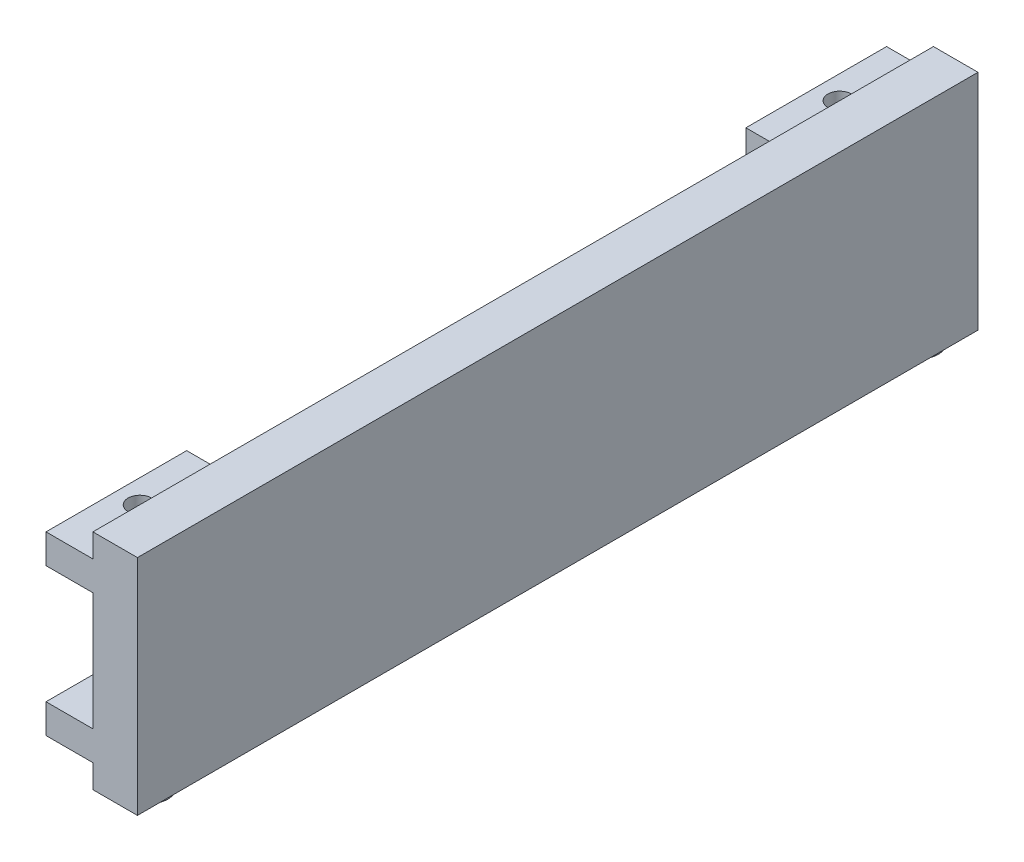
ISO-10303-21;
HEADER;
FILE_DESCRIPTION(('STEP AP214'),'2;1');
FILE_NAME('part.step','',(''),(''),'','','');
FILE_SCHEMA(('AUTOMOTIVE_DESIGN { 1 0 10303 214 1 1 1 1 }'));
ENDSEC;
DATA;
#1=APPLICATION_CONTEXT('core data for automotive mechanical design processes');
#2=APPLICATION_PROTOCOL_DEFINITION('international standard','automotive_design',2000,#1);
#3=PRODUCT_CONTEXT('',#1,'mechanical');
#4=PRODUCT('Part','Part','',(#3));
#5=PRODUCT_RELATED_PRODUCT_CATEGORY('part','',(#4));
#6=PRODUCT_DEFINITION_FORMATION('','',#4);
#7=PRODUCT_DEFINITION_CONTEXT('part definition',#1,'design');
#8=PRODUCT_DEFINITION('design','',#6,#7);
#9=PRODUCT_DEFINITION_SHAPE('','',#8);
#10=(LENGTH_UNIT() NAMED_UNIT(*) SI_UNIT(.MILLI.,.METRE.));
#11=(NAMED_UNIT(*) PLANE_ANGLE_UNIT() SI_UNIT($,.RADIAN.));
#12=(NAMED_UNIT(*) SI_UNIT($,.STERADIAN.) SOLID_ANGLE_UNIT());
#13=UNCERTAINTY_MEASURE_WITH_UNIT(LENGTH_MEASURE(1.E-05),#10,'distance_accuracy_value','');
#14=(GEOMETRIC_REPRESENTATION_CONTEXT(3) GLOBAL_UNCERTAINTY_ASSIGNED_CONTEXT((#13)) GLOBAL_UNIT_ASSIGNED_CONTEXT((#10,
#11,#12)) REPRESENTATION_CONTEXT('',''));
#15=CARTESIAN_POINT('',(0.,0.,0.));
#16=DIRECTION('',(0.,0.,1.));
#17=DIRECTION('',(1.,0.,0.));
#18=AXIS2_PLACEMENT_3D('',#15,#16,#17);
#19=CARTESIAN_POINT('',(1.54028436018947,190.5,3.0805687203792));
#20=DIRECTION('',(1.,0.,0.));
#21=DIRECTION('',(0.,0.,-1.));
#22=AXIS2_PLACEMENT_3D('',#19,#20,#21);
#23=PLANE('',#22);
#24=DIRECTION('',(0.,0.,-1.));
#25=VECTOR('',#24,1.);
#26=CARTESIAN_POINT('',(1.54028436018947,170.5,720.080568720379));
#27=LINE('',#26,#25);
#28=CARTESIAN_POINT('',(1.54028436018947,170.5,720.080568720379));
#29=VERTEX_POINT('',#28);
#30=CARTESIAN_POINT('',(1.54028436018947,170.5,600.080568720379));
#31=VERTEX_POINT('',#30);
#32=EDGE_CURVE('E186',#29,#31,#27,.T.);
#33=ORIENTED_EDGE('',*,*,#32,.F.);
#34=DIRECTION('',(0.,-1.,0.));
#35=VECTOR('',#34,1.);
#36=CARTESIAN_POINT('',(1.54028436018956,190.5,720.080568720379));
#37=LINE('',#36,#35);
#38=CARTESIAN_POINT('',(1.54028436018956,190.5,720.080568720379));
#39=VERTEX_POINT('',#38);
#40=EDGE_CURVE('E323',#39,#29,#37,.T.);
#41=ORIENTED_EDGE('',*,*,#40,.F.);
#42=DIRECTION('',(0.,0.,1.));
#43=VECTOR('',#42,1.);
#44=CARTESIAN_POINT('',(1.54028436018947,190.5,3.0805687203792));
#45=LINE('',#44,#43);
#46=CARTESIAN_POINT('',(1.54028436018947,190.5,3.0805687203792));
#47=VERTEX_POINT('',#46);
#48=EDGE_CURVE('E294',#47,#39,#45,.T.);
#49=ORIENTED_EDGE('',*,*,#48,.F.);
#50=DIRECTION('',(0.,-1.,0.));
#51=VECTOR('',#50,1.);
#52=CARTESIAN_POINT('',(1.54028436018947,190.5,3.0805687203792));
#53=LINE('',#52,#51);
#54=CARTESIAN_POINT('',(1.54028436018947,170.5,3.0805687203792));
#55=VERTEX_POINT('',#54);
#56=EDGE_CURVE('E313',#47,#55,#53,.T.);
#57=ORIENTED_EDGE('',*,*,#56,.T.);
#58=DIRECTION('',(0.,0.,-1.));
#59=VECTOR('',#58,1.);
#60=CARTESIAN_POINT('',(1.54028436018947,170.5,3.0805687203792));
#61=LINE('',#60,#59);
#62=CARTESIAN_POINT('',(1.54028436018947,170.5,123.080568720379));
#63=VERTEX_POINT('',#62);
#64=EDGE_CURVE('E268',#63,#55,#61,.T.);
#65=ORIENTED_EDGE('',*,*,#64,.F.);
#66=DIRECTION('',(0.,1.,0.));
#67=VECTOR('',#66,1.);
#68=CARTESIAN_POINT('',(1.54028436018947,170.5,123.080568720379));
#69=LINE('',#68,#67);
#70=CARTESIAN_POINT('',(1.54028436018947,145.5,123.080568720379));
#71=VERTEX_POINT('',#70);
#72=EDGE_CURVE('E277',#71,#63,#69,.T.);
#73=ORIENTED_EDGE('',*,*,#72,.F.);
#74=DIRECTION('',(0.,0.,1.));
#75=VECTOR('',#74,1.);
#76=CARTESIAN_POINT('',(1.54028436018947,145.5,3.0805687203792));
#77=LINE('',#76,#75);
#78=CARTESIAN_POINT('',(1.54028436018947,145.5,3.0805687203792));
#79=VERTEX_POINT('',#78);
#80=EDGE_CURVE('E256',#79,#71,#77,.T.);
#81=ORIENTED_EDGE('',*,*,#80,.F.);
#82=CARTESIAN_POINT('',(1.54028436018947,45.,3.0805687203792));
#83=VERTEX_POINT('',#82);
#84=EDGE_CURVE('E316',#79,#83,#53,.T.);
#85=ORIENTED_EDGE('',*,*,#84,.T.);
#86=DIRECTION('',(0.,0.,-1.));
#87=VECTOR('',#86,1.);
#88=CARTESIAN_POINT('',(1.54028436018947,45.,3.0805687203792));
#89=LINE('',#88,#87);
#90=CARTESIAN_POINT('',(1.54028436018949,45.,123.080568720379));
#91=VERTEX_POINT('',#90);
#92=EDGE_CURVE('E246',#91,#83,#89,.T.);
#93=ORIENTED_EDGE('',*,*,#92,.F.);
#94=DIRECTION('',(0.,1.,0.));
#95=VECTOR('',#94,1.);
#96=CARTESIAN_POINT('',(1.54028436018947,45.,123.080568720379));
#97=LINE('',#96,#95);
#98=CARTESIAN_POINT('',(1.54028436018949,20.,123.080568720379));
#99=VERTEX_POINT('',#98);
#100=EDGE_CURVE('E249',#99,#91,#97,.T.);
#101=ORIENTED_EDGE('',*,*,#100,.F.);
#102=DIRECTION('',(0.,0.,1.));
#103=VECTOR('',#102,1.);
#104=CARTESIAN_POINT('',(1.54028436018947,20.,3.0805687203792));
#105=LINE('',#104,#103);
#106=CARTESIAN_POINT('',(1.54028436018947,20.,3.0805687203792));
#107=VERTEX_POINT('',#106);
#108=EDGE_CURVE('E253',#107,#99,#105,.T.);
#109=ORIENTED_EDGE('',*,*,#108,.F.);
#110=CARTESIAN_POINT('',(1.54028436018947,0.,3.0805687203792));
#111=VERTEX_POINT('',#110);
#112=EDGE_CURVE('E304',#107,#111,#53,.T.);
#113=ORIENTED_EDGE('',*,*,#112,.T.);
#114=DIRECTION('',(0.,0.,1.));
#115=VECTOR('',#114,1.);
#116=CARTESIAN_POINT('',(1.54028436018947,0.,3.0805687203792));
#117=LINE('',#116,#115);
#118=CARTESIAN_POINT('',(1.54028436018956,0.,720.080568720379));
#119=VERTEX_POINT('',#118);
#120=EDGE_CURVE('E293',#111,#119,#117,.T.);
#121=ORIENTED_EDGE('',*,*,#120,.T.);
#122=CARTESIAN_POINT('',(1.54028436018956,20.,720.080568720379));
#123=VERTEX_POINT('',#122);
#124=EDGE_CURVE('E322',#123,#119,#37,.T.);
#125=ORIENTED_EDGE('',*,*,#124,.F.);
#126=DIRECTION('',(0.,0.,1.));
#127=VECTOR('',#126,1.);
#128=CARTESIAN_POINT('',(1.54028436018947,20.,720.080568720379));
#129=LINE('',#128,#127);
#130=CARTESIAN_POINT('',(1.54028436018947,20.,600.080568720379));
#131=VERTEX_POINT('',#130);
#132=EDGE_CURVE('E219',#131,#123,#129,.T.);
#133=ORIENTED_EDGE('',*,*,#132,.F.);
#134=DIRECTION('',(0.,-1.,0.));
#135=VECTOR('',#134,1.);
#136=CARTESIAN_POINT('',(1.54028436018947,45.,600.080568720379));
#137=LINE('',#136,#135);
#138=CARTESIAN_POINT('',(1.54028436018947,45.,600.080568720379));
#139=VERTEX_POINT('',#138);
#140=EDGE_CURVE('E221',#139,#131,#137,.T.);
#141=ORIENTED_EDGE('',*,*,#140,.F.);
#142=DIRECTION('',(0.,0.,-1.));
#143=VECTOR('',#142,1.);
#144=CARTESIAN_POINT('',(1.54028436018947,45.,720.080568720379));
#145=LINE('',#144,#143);
#146=CARTESIAN_POINT('',(1.54028436018947,45.,720.080568720379));
#147=VERTEX_POINT('',#146);
#148=EDGE_CURVE('E224',#147,#139,#145,.T.);
#149=ORIENTED_EDGE('',*,*,#148,.F.);
#150=CARTESIAN_POINT('',(1.54028436018956,145.5,720.080568720379));
#151=VERTEX_POINT('',#150);
#152=EDGE_CURVE('E195',#151,#147,#37,.T.);
#153=ORIENTED_EDGE('',*,*,#152,.F.);
#154=DIRECTION('',(0.,0.,1.));
#155=VECTOR('',#154,1.);
#156=CARTESIAN_POINT('',(1.54028436018947,145.5,720.080568720379));
#157=LINE('',#156,#155);
#158=CARTESIAN_POINT('',(1.54028436018947,145.5,600.080568720379));
#159=VERTEX_POINT('',#158);
#160=EDGE_CURVE('E187',#159,#151,#157,.T.);
#161=ORIENTED_EDGE('',*,*,#160,.F.);
#162=DIRECTION('',(0.,-1.,0.));
#163=VECTOR('',#162,1.);
#164=CARTESIAN_POINT('',(1.54028436018947,170.5,600.080568720379));
#165=LINE('',#164,#163);
#166=EDGE_CURVE('E175',#31,#159,#165,.T.);
#167=ORIENTED_EDGE('',*,*,#166,.F.);
#168=EDGE_LOOP('',(#33,#41,#49,#57,#65,#73,#81,#85,#93,#101,#109,#113,#121,#125,#133,#141,#149,
#153,#161,#167));
#169=FACE_BOUND('',#168,.T.);
#170=ADVANCED_FACE('F37',(#169),#23,.F.);
#171=CARTESIAN_POINT('',(1.54028436018956,190.5,720.080568720379));
#172=DIRECTION('',(0.,0.,-1.));
#173=DIRECTION('',(-1.,0.,0.));
#174=AXIS2_PLACEMENT_3D('',#171,#172,#173);
#175=PLANE('',#174);
#176=DIRECTION('',(1.,0.,0.));
#177=VECTOR('',#176,1.);
#178=CARTESIAN_POINT('',(1.54028436018956,0.,720.080568720379));
#179=LINE('',#178,#177);
#180=CARTESIAN_POINT('',(39.5402843601896,0.,720.080568720379));
#181=VERTEX_POINT('',#180);
#182=EDGE_CURVE('E307',#119,#181,#179,.T.);
#183=ORIENTED_EDGE('',*,*,#182,.T.);
#184=DIRECTION('',(0.,-1.,0.));
#185=VECTOR('',#184,1.);
#186=CARTESIAN_POINT('',(39.5402843601896,190.5,720.080568720379));
#187=LINE('',#186,#185);
#188=CARTESIAN_POINT('',(39.5402843601896,190.5,720.080568720379));
#189=VERTEX_POINT('',#188);
#190=EDGE_CURVE('E319',#189,#181,#187,.T.);
#191=ORIENTED_EDGE('',*,*,#190,.F.);
#192=DIRECTION('',(1.,0.,0.));
#193=VECTOR('',#192,1.);
#194=CARTESIAN_POINT('',(1.54028436018956,190.5,720.080568720379));
#195=LINE('',#194,#193);
#196=EDGE_CURVE('E297',#39,#189,#195,.T.);
#197=ORIENTED_EDGE('',*,*,#196,.F.);
#198=ORIENTED_EDGE('',*,*,#40,.T.);
#199=DIRECTION('',(1.,0.,0.));
#200=VECTOR('',#199,1.);
#201=CARTESIAN_POINT('',(-38.4597156398105,170.5,720.080568720379));
#202=LINE('',#201,#200);
#203=CARTESIAN_POINT('',(-38.4597156398105,170.5,720.080568720379));
#204=VERTEX_POINT('',#203);
#205=EDGE_CURVE('E459',#204,#29,#202,.T.);
#206=ORIENTED_EDGE('',*,*,#205,.F.);
#207=DIRECTION('',(0.,1.,0.));
#208=VECTOR('',#207,1.);
#209=CARTESIAN_POINT('',(-38.4597156398105,170.5,720.080568720379));
#210=LINE('',#209,#208);
#211=CARTESIAN_POINT('',(-38.4597156398105,145.5,720.080568720379));
#212=VERTEX_POINT('',#211);
#213=EDGE_CURVE('E196',#212,#204,#210,.T.);
#214=ORIENTED_EDGE('',*,*,#213,.F.);
#215=DIRECTION('',(1.,0.,0.));
#216=VECTOR('',#215,1.);
#217=CARTESIAN_POINT('',(-38.4597156398105,145.5,720.080568720379));
#218=LINE('',#217,#216);
#219=EDGE_CURVE('E51',#212,#151,#218,.T.);
#220=ORIENTED_EDGE('',*,*,#219,.T.);
#221=ORIENTED_EDGE('',*,*,#152,.T.);
#222=DIRECTION('',(1.,0.,0.));
#223=VECTOR('',#222,1.);
#224=CARTESIAN_POINT('',(-38.4597156398105,45.,720.080568720379));
#225=LINE('',#224,#223);
#226=CARTESIAN_POINT('',(-38.4597156398105,45.,720.080568720379));
#227=VERTEX_POINT('',#226);
#228=EDGE_CURVE('E204',#227,#147,#225,.T.);
#229=ORIENTED_EDGE('',*,*,#228,.F.);
#230=DIRECTION('',(0.,1.,0.));
#231=VECTOR('',#230,1.);
#232=CARTESIAN_POINT('',(-38.4597156398105,45.,720.080568720379));
#233=LINE('',#232,#231);
#234=CARTESIAN_POINT('',(-38.4597156398105,20.,720.080568720379));
#235=VERTEX_POINT('',#234);
#236=EDGE_CURVE('E222',#235,#227,#233,.T.);
#237=ORIENTED_EDGE('',*,*,#236,.F.);
#238=DIRECTION('',(1.,0.,0.));
#239=VECTOR('',#238,1.);
#240=CARTESIAN_POINT('',(-38.4597156398105,20.,720.080568720379));
#241=LINE('',#240,#239);
#242=EDGE_CURVE('E58',#235,#123,#241,.T.);
#243=ORIENTED_EDGE('',*,*,#242,.T.);
#244=ORIENTED_EDGE('',*,*,#124,.T.);
#245=EDGE_LOOP('',(#183,#191,#197,#198,#206,#214,#220,#221,#229,#237,#243,#244));
#246=FACE_BOUND('',#245,.T.);
#247=ADVANCED_FACE('F364',(#246),#175,.F.);
#248=CARTESIAN_POINT('',(39.5402843601895,190.5,3.0805687203792));
#249=DIRECTION('',(-1.,0.,0.));
#250=DIRECTION('',(0.,0.,1.));
#251=AXIS2_PLACEMENT_3D('',#248,#249,#250);
#252=PLANE('',#251);
#253=DIRECTION('',(0.,0.,-1.));
#254=VECTOR('',#253,1.);
#255=CARTESIAN_POINT('',(39.5402843601895,0.,3.0805687203792));
#256=LINE('',#255,#254);
#257=CARTESIAN_POINT('',(39.5402843601895,0.,3.0805687203792));
#258=VERTEX_POINT('',#257);
#259=EDGE_CURVE('E309',#181,#258,#256,.T.);
#260=ORIENTED_EDGE('',*,*,#259,.T.);
#261=DIRECTION('',(0.,-1.,0.));
#262=VECTOR('',#261,1.);
#263=CARTESIAN_POINT('',(39.5402843601895,190.5,3.0805687203792));
#264=LINE('',#263,#262);
#265=CARTESIAN_POINT('',(39.5402843601895,190.5,3.0805687203792));
#266=VERTEX_POINT('',#265);
#267=EDGE_CURVE('E315',#266,#258,#264,.T.);
#268=ORIENTED_EDGE('',*,*,#267,.F.);
#269=DIRECTION('',(0.,0.,-1.));
#270=VECTOR('',#269,1.);
#271=CARTESIAN_POINT('',(39.5402843601895,190.5,3.0805687203792));
#272=LINE('',#271,#270);
#273=EDGE_CURVE('E300',#189,#266,#272,.T.);
#274=ORIENTED_EDGE('',*,*,#273,.F.);
#275=ORIENTED_EDGE('',*,*,#190,.T.);
#276=EDGE_LOOP('',(#260,#268,#274,#275));
#277=FACE_BOUND('',#276,.T.);
#278=ADVANCED_FACE('F362',(#277),#252,.F.);
#279=CARTESIAN_POINT('',(1.54028436018947,190.5,3.0805687203792));
#280=DIRECTION('',(0.,0.,1.));
#281=DIRECTION('',(1.,0.,0.));
#282=AXIS2_PLACEMENT_3D('',#279,#280,#281);
#283=PLANE('',#282);
#284=DIRECTION('',(-1.,0.,0.));
#285=VECTOR('',#284,1.);
#286=CARTESIAN_POINT('',(1.54028436018947,0.,3.0805687203792));
#287=LINE('',#286,#285);
#288=EDGE_CURVE('E298',#258,#111,#287,.T.);
#289=ORIENTED_EDGE('',*,*,#288,.T.);
#290=ORIENTED_EDGE('',*,*,#112,.F.);
#291=DIRECTION('',(1.,0.,0.));
#292=VECTOR('',#291,1.);
#293=CARTESIAN_POINT('',(-38.4597156398105,20.,3.0805687203792));
#294=LINE('',#293,#292);
#295=CARTESIAN_POINT('',(-38.4597156398105,20.,3.0805687203792));
#296=VERTEX_POINT('',#295);
#297=EDGE_CURVE('E226',#296,#107,#294,.T.);
#298=ORIENTED_EDGE('',*,*,#297,.F.);
#299=DIRECTION('',(0.,-1.,0.));
#300=VECTOR('',#299,1.);
#301=CARTESIAN_POINT('',(-38.4597156398105,45.,3.0805687203792));
#302=LINE('',#301,#300);
#303=CARTESIAN_POINT('',(-38.4597156398105,45.,3.0805687203792));
#304=VERTEX_POINT('',#303);
#305=EDGE_CURVE('E250',#304,#296,#302,.T.);
#306=ORIENTED_EDGE('',*,*,#305,.F.);
#307=DIRECTION('',(1.,0.,0.));
#308=VECTOR('',#307,1.);
#309=CARTESIAN_POINT('',(-38.4597156398105,45.,3.0805687203792));
#310=LINE('',#309,#308);
#311=EDGE_CURVE('E242',#304,#83,#310,.T.);
#312=ORIENTED_EDGE('',*,*,#311,.T.);
#313=ORIENTED_EDGE('',*,*,#84,.F.);
#314=DIRECTION('',(1.,0.,0.));
#315=VECTOR('',#314,1.);
#316=CARTESIAN_POINT('',(-38.4597156398105,145.5,3.0805687203792));
#317=LINE('',#316,#315);
#318=CARTESIAN_POINT('',(-38.4597156398105,145.5,3.0805687203792));
#319=VERTEX_POINT('',#318);
#320=EDGE_CURVE('E290',#319,#79,#317,.T.);
#321=ORIENTED_EDGE('',*,*,#320,.F.);
#322=DIRECTION('',(0.,-1.,0.));
#323=VECTOR('',#322,1.);
#324=CARTESIAN_POINT('',(-38.4597156398105,170.5,3.0805687203792));
#325=LINE('',#324,#323);
#326=CARTESIAN_POINT('',(-38.4597156398105,170.5,3.0805687203792));
#327=VERTEX_POINT('',#326);
#328=EDGE_CURVE('E264',#327,#319,#325,.T.);
#329=ORIENTED_EDGE('',*,*,#328,.F.);
#330=DIRECTION('',(1.,0.,0.));
#331=VECTOR('',#330,1.);
#332=CARTESIAN_POINT('',(-38.4597156398105,170.5,3.0805687203792));
#333=LINE('',#332,#331);
#334=EDGE_CURVE('E274',#327,#55,#333,.T.);
#335=ORIENTED_EDGE('',*,*,#334,.T.);
#336=ORIENTED_EDGE('',*,*,#56,.F.);
#337=DIRECTION('',(-1.,0.,0.));
#338=VECTOR('',#337,1.);
#339=CARTESIAN_POINT('',(1.54028436018947,190.5,3.0805687203792));
#340=LINE('',#339,#338);
#341=EDGE_CURVE('E302',#266,#47,#340,.T.);
#342=ORIENTED_EDGE('',*,*,#341,.F.);
#343=ORIENTED_EDGE('',*,*,#267,.T.);
#344=EDGE_LOOP('',(#289,#290,#298,#306,#312,#313,#321,#329,#335,#336,#342,#343));
#345=FACE_BOUND('',#344,.T.);
#346=ADVANCED_FACE('F356',(#345),#283,.F.);
#347=CARTESIAN_POINT('',(0.,190.5,0.));
#348=DIRECTION('',(0.,1.,0.));
#349=DIRECTION('',(0.,0.,1.));
#350=AXIS2_PLACEMENT_3D('',#347,#348,#349);
#351=PLANE('',#350);
#352=ORIENTED_EDGE('',*,*,#48,.T.);
#353=ORIENTED_EDGE('',*,*,#196,.T.);
#354=ORIENTED_EDGE('',*,*,#273,.T.);
#355=ORIENTED_EDGE('',*,*,#341,.T.);
#356=EDGE_LOOP('',(#352,#353,#354,#355));
#357=FACE_BOUND('',#356,.T.);
#358=ADVANCED_FACE('F344',(#357),#351,.T.);
#359=CARTESIAN_POINT('',(0.,0.,0.));
#360=DIRECTION('',(0.,1.,0.));
#361=DIRECTION('',(0.,0.,1.));
#362=AXIS2_PLACEMENT_3D('',#359,#360,#361);
#363=PLANE('',#362);
#364=CARTESIAN_POINT('',(20.5402843601896,0.,33.0805687203792));
#365=DIRECTION('',(0.,1.,0.));
#366=DIRECTION('',(0.,0.,1.));
#367=AXIS2_PLACEMENT_3D('',#364,#365,#366);
#368=CIRCLE('',#367,15.);
#369=CARTESIAN_POINT('',(20.5402843601896,0.,48.0805687203792));
#370=VERTEX_POINT('',#369);
#371=EDGE_CURVE('E11',#370,#370,#368,.F.);
#372=ORIENTED_EDGE('',*,*,#371,.F.);
#373=EDGE_LOOP('',(#372));
#374=FACE_BOUND('',#373,.T.);
#375=CARTESIAN_POINT('',(20.5402843601896,0.,690.080568720379));
#376=DIRECTION('',(0.,1.,0.));
#377=DIRECTION('',(0.,0.,1.));
#378=AXIS2_PLACEMENT_3D('',#375,#376,#377);
#379=CIRCLE('',#378,15.);
#380=CARTESIAN_POINT('',(20.5402843601896,0.,705.080568720379));
#381=VERTEX_POINT('',#380);
#382=EDGE_CURVE('E44',#381,#381,#379,.F.);
#383=ORIENTED_EDGE('',*,*,#382,.F.);
#384=EDGE_LOOP('',(#383));
#385=FACE_BOUND('',#384,.T.);
#386=ORIENTED_EDGE('',*,*,#120,.F.);
#387=ORIENTED_EDGE('',*,*,#288,.F.);
#388=ORIENTED_EDGE('',*,*,#259,.F.);
#389=ORIENTED_EDGE('',*,*,#182,.F.);
#390=EDGE_LOOP('',(#386,#387,#388,#389));
#391=FACE_BOUND('',#390,.T.);
#392=ADVANCED_FACE('F340',(#374,#385,#391),#363,.F.);
#393=CARTESIAN_POINT('',(-38.4597156398105,145.5,3.0805687203792));
#394=DIRECTION('',(0.,1.,0.));
#395=DIRECTION('',(0.,0.,1.));
#396=AXIS2_PLACEMENT_3D('',#393,#394,#395);
#397=PLANE('',#396);
#398=CARTESIAN_POINT('',(-18.4597156398105,145.5,63.0805687203792));
#399=DIRECTION('',(0.,1.,0.));
#400=DIRECTION('',(0.,0.,1.));
#401=AXIS2_PLACEMENT_3D('',#398,#399,#400);
#402=CIRCLE('',#401,10.);
#403=CARTESIAN_POINT('',(-18.4597156398105,145.5,73.0805687203792));
#404=VERTEX_POINT('',#403);
#405=EDGE_CURVE('E461',#404,#404,#402,.T.);
#406=ORIENTED_EDGE('',*,*,#405,.T.);
#407=EDGE_LOOP('',(#406));
#408=FACE_BOUND('',#407,.T.);
#409=ORIENTED_EDGE('',*,*,#80,.T.);
#410=DIRECTION('',(1.,0.,0.));
#411=VECTOR('',#410,1.);
#412=CARTESIAN_POINT('',(-38.4597156398105,145.5,123.080568720379));
#413=LINE('',#412,#411);
#414=CARTESIAN_POINT('',(-38.4597156398105,145.5,123.080568720379));
#415=VERTEX_POINT('',#414);
#416=EDGE_CURVE('E287',#415,#71,#413,.T.);
#417=ORIENTED_EDGE('',*,*,#416,.F.);
#418=DIRECTION('',(0.,0.,1.));
#419=VECTOR('',#418,1.);
#420=CARTESIAN_POINT('',(-38.4597156398105,145.5,3.0805687203792));
#421=LINE('',#420,#419);
#422=EDGE_CURVE('E267',#319,#415,#421,.T.);
#423=ORIENTED_EDGE('',*,*,#422,.F.);
#424=ORIENTED_EDGE('',*,*,#320,.T.);
#425=EDGE_LOOP('',(#409,#417,#423,#424));
#426=FACE_BOUND('',#425,.T.);
#427=ADVANCED_FACE('F343',(#408,#426),#397,.F.);
#428=CARTESIAN_POINT('',(-38.4597156398105,170.5,123.080568720379));
#429=DIRECTION('',(0.,0.,-1.));
#430=DIRECTION('',(-1.,0.,0.));
#431=AXIS2_PLACEMENT_3D('',#428,#429,#430);
#432=PLANE('',#431);
#433=ORIENTED_EDGE('',*,*,#72,.T.);
#434=DIRECTION('',(1.,0.,0.));
#435=VECTOR('',#434,1.);
#436=CARTESIAN_POINT('',(-38.4597156398105,170.5,123.080568720379));
#437=LINE('',#436,#435);
#438=CARTESIAN_POINT('',(-38.4597156398105,170.5,123.080568720379));
#439=VERTEX_POINT('',#438);
#440=EDGE_CURVE('E284',#439,#63,#437,.T.);
#441=ORIENTED_EDGE('',*,*,#440,.F.);
#442=DIRECTION('',(0.,1.,0.));
#443=VECTOR('',#442,1.);
#444=CARTESIAN_POINT('',(-38.4597156398105,170.5,123.080568720379));
#445=LINE('',#444,#443);
#446=EDGE_CURVE('E270',#415,#439,#445,.T.);
#447=ORIENTED_EDGE('',*,*,#446,.F.);
#448=ORIENTED_EDGE('',*,*,#416,.T.);
#449=EDGE_LOOP('',(#433,#441,#447,#448));
#450=FACE_BOUND('',#449,.T.);
#451=ADVANCED_FACE('F407',(#450),#432,.F.);
#452=CARTESIAN_POINT('',(-38.4597156398105,170.5,3.0805687203792));
#453=DIRECTION('',(0.,-1.,0.));
#454=DIRECTION('',(0.,0.,-1.));
#455=AXIS2_PLACEMENT_3D('',#452,#453,#454);
#456=PLANE('',#455);
#457=CARTESIAN_POINT('',(-18.4597156398105,170.5,63.0805687203792));
#458=DIRECTION('',(0.,1.,0.));
#459=DIRECTION('',(0.,0.,1.));
#460=AXIS2_PLACEMENT_3D('',#457,#458,#459);
#461=CIRCLE('',#460,10.);
#462=CARTESIAN_POINT('',(-18.4597156398105,170.5,73.0805687203792));
#463=VERTEX_POINT('',#462);
#464=EDGE_CURVE('E330',#463,#463,#461,.T.);
#465=ORIENTED_EDGE('',*,*,#464,.F.);
#466=EDGE_LOOP('',(#465));
#467=FACE_BOUND('',#466,.T.);
#468=ORIENTED_EDGE('',*,*,#64,.T.);
#469=ORIENTED_EDGE('',*,*,#334,.F.);
#470=DIRECTION('',(0.,0.,-1.));
#471=VECTOR('',#470,1.);
#472=CARTESIAN_POINT('',(-38.4597156398105,170.5,3.0805687203792));
#473=LINE('',#472,#471);
#474=EDGE_CURVE('E272',#439,#327,#473,.T.);
#475=ORIENTED_EDGE('',*,*,#474,.F.);
#476=ORIENTED_EDGE('',*,*,#440,.T.);
#477=EDGE_LOOP('',(#468,#469,#475,#476));
#478=FACE_BOUND('',#477,.T.);
#479=ADVANCED_FACE('F411',(#467,#478),#456,.F.);
#480=CARTESIAN_POINT('',(-38.4597156398105,0.,0.));
#481=DIRECTION('',(-1.,0.,0.));
#482=DIRECTION('',(0.,0.,1.));
#483=AXIS2_PLACEMENT_3D('',#480,#481,#482);
#484=PLANE('',#483);
#485=ORIENTED_EDGE('',*,*,#328,.T.);
#486=ORIENTED_EDGE('',*,*,#422,.T.);
#487=ORIENTED_EDGE('',*,*,#446,.T.);
#488=ORIENTED_EDGE('',*,*,#474,.T.);
#489=EDGE_LOOP('',(#485,#486,#487,#488));
#490=FACE_BOUND('',#489,.T.);
#491=ADVANCED_FACE('F415',(#490),#484,.T.);
#492=CARTESIAN_POINT('',(-38.4597156398105,20.,3.0805687203792));
#493=DIRECTION('',(0.,1.,0.));
#494=DIRECTION('',(0.,0.,1.));
#495=AXIS2_PLACEMENT_3D('',#492,#493,#494);
#496=PLANE('',#495);
#497=CARTESIAN_POINT('',(-18.4597156398105,20.,63.0805687203792));
#498=DIRECTION('',(0.,1.,0.));
#499=DIRECTION('',(0.,0.,1.));
#500=AXIS2_PLACEMENT_3D('',#497,#498,#499);
#501=CIRCLE('',#500,10.);
#502=CARTESIAN_POINT('',(-18.4597156398105,20.,73.0805687203792));
#503=VERTEX_POINT('',#502);
#504=EDGE_CURVE('E333',#503,#503,#501,.T.);
#505=ORIENTED_EDGE('',*,*,#504,.T.);
#506=EDGE_LOOP('',(#505));
#507=FACE_BOUND('',#506,.T.);
#508=ORIENTED_EDGE('',*,*,#108,.T.);
#509=DIRECTION('',(1.,0.,0.));
#510=VECTOR('',#509,1.);
#511=CARTESIAN_POINT('',(-38.4597156398105,20.,123.080568720379));
#512=LINE('',#511,#510);
#513=CARTESIAN_POINT('',(-38.4597156398105,20.,123.080568720379));
#514=VERTEX_POINT('',#513);
#515=EDGE_CURVE('E236',#514,#99,#512,.T.);
#516=ORIENTED_EDGE('',*,*,#515,.F.);
#517=DIRECTION('',(0.,0.,1.));
#518=VECTOR('',#517,1.);
#519=CARTESIAN_POINT('',(-38.4597156398105,20.,3.0805687203792));
#520=LINE('',#519,#518);
#521=EDGE_CURVE('E260',#296,#514,#520,.T.);
#522=ORIENTED_EDGE('',*,*,#521,.F.);
#523=ORIENTED_EDGE('',*,*,#297,.T.);
#524=EDGE_LOOP('',(#508,#516,#522,#523));
#525=FACE_BOUND('',#524,.T.);
#526=ADVANCED_FACE('F419',(#507,#525),#496,.F.);
#527=CARTESIAN_POINT('',(-38.4597156398105,45.,123.080568720379));
#528=DIRECTION('',(0.,0.,-1.));
#529=DIRECTION('',(-1.,0.,0.));
#530=AXIS2_PLACEMENT_3D('',#527,#528,#529);
#531=PLANE('',#530);
#532=ORIENTED_EDGE('',*,*,#100,.T.);
#533=DIRECTION('',(1.,0.,0.));
#534=VECTOR('',#533,1.);
#535=CARTESIAN_POINT('',(-38.4597156398105,45.,123.080568720379));
#536=LINE('',#535,#534);
#537=CARTESIAN_POINT('',(-38.4597156398105,45.,123.080568720379));
#538=VERTEX_POINT('',#537);
#539=EDGE_CURVE('E239',#538,#91,#536,.T.);
#540=ORIENTED_EDGE('',*,*,#539,.F.);
#541=DIRECTION('',(0.,1.,0.));
#542=VECTOR('',#541,1.);
#543=CARTESIAN_POINT('',(-38.4597156398105,45.,123.080568720379));
#544=LINE('',#543,#542);
#545=EDGE_CURVE('E258',#514,#538,#544,.T.);
#546=ORIENTED_EDGE('',*,*,#545,.F.);
#547=ORIENTED_EDGE('',*,*,#515,.T.);
#548=EDGE_LOOP('',(#532,#540,#546,#547));
#549=FACE_BOUND('',#548,.T.);
#550=ADVANCED_FACE('F428',(#549),#531,.F.);
#551=CARTESIAN_POINT('',(-38.4597156398105,45.,3.0805687203792));
#552=DIRECTION('',(0.,-1.,0.));
#553=DIRECTION('',(0.,0.,-1.));
#554=AXIS2_PLACEMENT_3D('',#551,#552,#553);
#555=PLANE('',#554);
#556=CARTESIAN_POINT('',(-18.4597156398105,45.,63.0805687203792));
#557=DIRECTION('',(0.,-1.,0.));
#558=DIRECTION('',(0.,0.,-1.));
#559=AXIS2_PLACEMENT_3D('',#556,#557,#558);
#560=CIRCLE('',#559,10.);
#561=CARTESIAN_POINT('',(-18.4597156398105,45.,53.0805687203792));
#562=VERTEX_POINT('',#561);
#563=EDGE_CURVE('E331',#562,#562,#560,.T.);
#564=ORIENTED_EDGE('',*,*,#563,.T.);
#565=EDGE_LOOP('',(#564));
#566=FACE_BOUND('',#565,.T.);
#567=ORIENTED_EDGE('',*,*,#92,.T.);
#568=ORIENTED_EDGE('',*,*,#311,.F.);
#569=DIRECTION('',(0.,0.,-1.));
#570=VECTOR('',#569,1.);
#571=CARTESIAN_POINT('',(-38.4597156398105,45.,3.0805687203792));
#572=LINE('',#571,#570);
#573=EDGE_CURVE('E245',#538,#304,#572,.T.);
#574=ORIENTED_EDGE('',*,*,#573,.F.);
#575=ORIENTED_EDGE('',*,*,#539,.T.);
#576=EDGE_LOOP('',(#567,#568,#574,#575));
#577=FACE_BOUND('',#576,.T.);
#578=ADVANCED_FACE('F424',(#566,#577),#555,.F.);
#579=CARTESIAN_POINT('',(-38.4597156398105,0.,0.));
#580=DIRECTION('',(-1.,0.,0.));
#581=DIRECTION('',(0.,0.,1.));
#582=AXIS2_PLACEMENT_3D('',#579,#580,#581);
#583=PLANE('',#582);
#584=ORIENTED_EDGE('',*,*,#305,.T.);
#585=ORIENTED_EDGE('',*,*,#521,.T.);
#586=ORIENTED_EDGE('',*,*,#545,.T.);
#587=ORIENTED_EDGE('',*,*,#573,.T.);
#588=EDGE_LOOP('',(#584,#585,#586,#587));
#589=FACE_BOUND('',#588,.T.);
#590=ADVANCED_FACE('F421',(#589),#583,.T.);
#591=CARTESIAN_POINT('',(-38.4597156398105,45.,720.080568720379));
#592=DIRECTION('',(0.,-1.,0.));
#593=DIRECTION('',(0.,0.,-1.));
#594=AXIS2_PLACEMENT_3D('',#591,#592,#593);
#595=PLANE('',#594);
#596=CARTESIAN_POINT('',(-18.4597156398105,45.,660.080568720379));
#597=DIRECTION('',(0.,-1.,0.));
#598=DIRECTION('',(0.,0.,-1.));
#599=AXIS2_PLACEMENT_3D('',#596,#597,#598);
#600=CIRCLE('',#599,10.);
#601=CARTESIAN_POINT('',(-18.4597156398105,45.,650.080568720379));
#602=VERTEX_POINT('',#601);
#603=EDGE_CURVE('E334',#602,#602,#600,.T.);
#604=ORIENTED_EDGE('',*,*,#603,.T.);
#605=EDGE_LOOP('',(#604));
#606=FACE_BOUND('',#605,.T.);
#607=ORIENTED_EDGE('',*,*,#148,.T.);
#608=DIRECTION('',(1.,0.,0.));
#609=VECTOR('',#608,1.);
#610=CARTESIAN_POINT('',(-38.4597156398105,45.,600.080568720379));
#611=LINE('',#610,#609);
#612=CARTESIAN_POINT('',(-38.4597156398105,45.,600.080568720379));
#613=VERTEX_POINT('',#612);
#614=EDGE_CURVE('E211',#613,#139,#611,.T.);
#615=ORIENTED_EDGE('',*,*,#614,.F.);
#616=DIRECTION('',(0.,0.,-1.));
#617=VECTOR('',#616,1.);
#618=CARTESIAN_POINT('',(-38.4597156398105,45.,720.080568720379));
#619=LINE('',#618,#617);
#620=EDGE_CURVE('E230',#227,#613,#619,.T.);
#621=ORIENTED_EDGE('',*,*,#620,.F.);
#622=ORIENTED_EDGE('',*,*,#228,.T.);
#623=EDGE_LOOP('',(#607,#615,#621,#622));
#624=FACE_BOUND('',#623,.T.);
#625=ADVANCED_FACE('F367',(#606,#624),#595,.F.);
#626=CARTESIAN_POINT('',(-38.4597156398105,45.,600.080568720379));
#627=DIRECTION('',(0.,0.,1.));
#628=DIRECTION('',(1.,0.,0.));
#629=AXIS2_PLACEMENT_3D('',#626,#627,#628);
#630=PLANE('',#629);
#631=ORIENTED_EDGE('',*,*,#140,.T.);
#632=DIRECTION('',(1.,0.,0.));
#633=VECTOR('',#632,1.);
#634=CARTESIAN_POINT('',(-38.4597156398105,20.,600.080568720379));
#635=LINE('',#634,#633);
#636=CARTESIAN_POINT('',(-38.4597156398105,20.,600.080568720379));
#637=VERTEX_POINT('',#636);
#638=EDGE_CURVE('E214',#637,#131,#635,.T.);
#639=ORIENTED_EDGE('',*,*,#638,.F.);
#640=DIRECTION('',(0.,-1.,0.));
#641=VECTOR('',#640,1.);
#642=CARTESIAN_POINT('',(-38.4597156398105,45.,600.080568720379));
#643=LINE('',#642,#641);
#644=EDGE_CURVE('E228',#613,#637,#643,.T.);
#645=ORIENTED_EDGE('',*,*,#644,.F.);
#646=ORIENTED_EDGE('',*,*,#614,.T.);
#647=EDGE_LOOP('',(#631,#639,#645,#646));
#648=FACE_BOUND('',#647,.T.);
#649=ADVANCED_FACE('F372',(#648),#630,.F.);
#650=CARTESIAN_POINT('',(-38.4597156398105,20.,720.080568720379));
#651=DIRECTION('',(0.,1.,0.));
#652=DIRECTION('',(0.,0.,1.));
#653=AXIS2_PLACEMENT_3D('',#650,#651,#652);
#654=PLANE('',#653);
#655=CARTESIAN_POINT('',(-18.4597156398105,20.,660.080568720379));
#656=DIRECTION('',(0.,1.,0.));
#657=DIRECTION('',(0.,0.,1.));
#658=AXIS2_PLACEMENT_3D('',#655,#656,#657);
#659=CIRCLE('',#658,10.);
#660=CARTESIAN_POINT('',(-18.4597156398105,20.,670.080568720379));
#661=VERTEX_POINT('',#660);
#662=EDGE_CURVE('E329',#661,#661,#659,.T.);
#663=ORIENTED_EDGE('',*,*,#662,.T.);
#664=EDGE_LOOP('',(#663));
#665=FACE_BOUND('',#664,.T.);
#666=ORIENTED_EDGE('',*,*,#132,.T.);
#667=ORIENTED_EDGE('',*,*,#242,.F.);
#668=DIRECTION('',(0.,0.,1.));
#669=VECTOR('',#668,1.);
#670=CARTESIAN_POINT('',(-38.4597156398105,20.,720.080568720379));
#671=LINE('',#670,#669);
#672=EDGE_CURVE('E218',#637,#235,#671,.T.);
#673=ORIENTED_EDGE('',*,*,#672,.F.);
#674=ORIENTED_EDGE('',*,*,#638,.T.);
#675=EDGE_LOOP('',(#666,#667,#673,#674));
#676=FACE_BOUND('',#675,.T.);
#677=ADVANCED_FACE('F376',(#665,#676),#654,.F.);
#678=CARTESIAN_POINT('',(-38.4597156398105,0.,0.));
#679=DIRECTION('',(1.,0.,0.));
#680=DIRECTION('',(0.,0.,-1.));
#681=AXIS2_PLACEMENT_3D('',#678,#679,#680);
#682=PLANE('',#681);
#683=ORIENTED_EDGE('',*,*,#236,.T.);
#684=ORIENTED_EDGE('',*,*,#620,.T.);
#685=ORIENTED_EDGE('',*,*,#644,.T.);
#686=ORIENTED_EDGE('',*,*,#672,.T.);
#687=EDGE_LOOP('',(#683,#684,#685,#686));
#688=FACE_BOUND('',#687,.T.);
#689=ADVANCED_FACE('F378',(#688),#682,.F.);
#690=CARTESIAN_POINT('',(-38.4597156398105,170.5,720.080568720379));
#691=DIRECTION('',(0.,-1.,0.));
#692=DIRECTION('',(0.,0.,-1.));
#693=AXIS2_PLACEMENT_3D('',#690,#691,#692);
#694=PLANE('',#693);
#695=CARTESIAN_POINT('',(-18.4597156398105,170.5,660.080568720379));
#696=DIRECTION('',(0.,1.,0.));
#697=DIRECTION('',(0.,0.,1.));
#698=AXIS2_PLACEMENT_3D('',#695,#696,#697);
#699=CIRCLE('',#698,10.);
#700=CARTESIAN_POINT('',(-18.4597156398105,170.5,670.080568720379));
#701=VERTEX_POINT('',#700);
#702=EDGE_CURVE('E472',#701,#701,#699,.T.);
#703=ORIENTED_EDGE('',*,*,#702,.F.);
#704=EDGE_LOOP('',(#703));
#705=FACE_BOUND('',#704,.T.);
#706=ORIENTED_EDGE('',*,*,#32,.T.);
#707=DIRECTION('',(1.,0.,0.));
#708=VECTOR('',#707,1.);
#709=CARTESIAN_POINT('',(-38.4597156398105,170.5,600.080568720379));
#710=LINE('',#709,#708);
#711=CARTESIAN_POINT('',(-38.4597156398105,170.5,600.080568720379));
#712=VERTEX_POINT('',#711);
#713=EDGE_CURVE('E182',#712,#31,#710,.T.);
#714=ORIENTED_EDGE('',*,*,#713,.F.);
#715=DIRECTION('',(0.,0.,-1.));
#716=VECTOR('',#715,1.);
#717=CARTESIAN_POINT('',(-38.4597156398105,170.5,720.080568720379));
#718=LINE('',#717,#716);
#719=EDGE_CURVE('E199',#204,#712,#718,.T.);
#720=ORIENTED_EDGE('',*,*,#719,.F.);
#721=ORIENTED_EDGE('',*,*,#205,.T.);
#722=EDGE_LOOP('',(#706,#714,#720,#721));
#723=FACE_BOUND('',#722,.T.);
#724=ADVANCED_FACE('F380',(#705,#723),#694,.F.);
#725=CARTESIAN_POINT('',(-38.4597156398105,170.5,600.080568720379));
#726=DIRECTION('',(0.,0.,1.));
#727=DIRECTION('',(1.,0.,0.));
#728=AXIS2_PLACEMENT_3D('',#725,#726,#727);
#729=PLANE('',#728);
#730=ORIENTED_EDGE('',*,*,#166,.T.);
#731=DIRECTION('',(1.,0.,0.));
#732=VECTOR('',#731,1.);
#733=CARTESIAN_POINT('',(-38.4597156398105,145.5,600.080568720379));
#734=LINE('',#733,#732);
#735=CARTESIAN_POINT('',(-38.4597156398105,145.5,600.080568720379));
#736=VERTEX_POINT('',#735);
#737=EDGE_CURVE('E179',#736,#159,#734,.T.);
#738=ORIENTED_EDGE('',*,*,#737,.F.);
#739=DIRECTION('',(0.,-1.,0.));
#740=VECTOR('',#739,1.);
#741=CARTESIAN_POINT('',(-38.4597156398105,170.5,600.080568720379));
#742=LINE('',#741,#740);
#743=EDGE_CURVE('E206',#712,#736,#742,.T.);
#744=ORIENTED_EDGE('',*,*,#743,.F.);
#745=ORIENTED_EDGE('',*,*,#713,.T.);
#746=EDGE_LOOP('',(#730,#738,#744,#745));
#747=FACE_BOUND('',#746,.T.);
#748=ADVANCED_FACE('F177',(#747),#729,.F.);
#749=CARTESIAN_POINT('',(-38.4597156398105,145.5,720.080568720379));
#750=DIRECTION('',(0.,1.,0.));
#751=DIRECTION('',(0.,0.,1.));
#752=AXIS2_PLACEMENT_3D('',#749,#750,#751);
#753=PLANE('',#752);
#754=CARTESIAN_POINT('',(-18.4597156398105,145.5,660.080568720379));
#755=DIRECTION('',(0.,1.,0.));
#756=DIRECTION('',(0.,0.,1.));
#757=AXIS2_PLACEMENT_3D('',#754,#755,#756);
#758=CIRCLE('',#757,10.);
#759=CARTESIAN_POINT('',(-18.4597156398105,145.5,670.080568720379));
#760=VERTEX_POINT('',#759);
#761=EDGE_CURVE('E326',#760,#760,#758,.T.);
#762=ORIENTED_EDGE('',*,*,#761,.T.);
#763=EDGE_LOOP('',(#762));
#764=FACE_BOUND('',#763,.T.);
#765=ORIENTED_EDGE('',*,*,#160,.T.);
#766=ORIENTED_EDGE('',*,*,#219,.F.);
#767=DIRECTION('',(0.,0.,1.));
#768=VECTOR('',#767,1.);
#769=CARTESIAN_POINT('',(-38.4597156398105,145.5,720.080568720379));
#770=LINE('',#769,#768);
#771=EDGE_CURVE('E192',#736,#212,#770,.T.);
#772=ORIENTED_EDGE('',*,*,#771,.F.);
#773=ORIENTED_EDGE('',*,*,#737,.T.);
#774=EDGE_LOOP('',(#765,#766,#772,#773));
#775=FACE_BOUND('',#774,.T.);
#776=ADVANCED_FACE('F190',(#764,#775),#753,.F.);
#777=CARTESIAN_POINT('',(-38.4597156398105,0.,0.));
#778=DIRECTION('',(1.,0.,0.));
#779=DIRECTION('',(0.,0.,-1.));
#780=AXIS2_PLACEMENT_3D('',#777,#778,#779);
#781=PLANE('',#780);
#782=ORIENTED_EDGE('',*,*,#213,.T.);
#783=ORIENTED_EDGE('',*,*,#719,.T.);
#784=ORIENTED_EDGE('',*,*,#743,.T.);
#785=ORIENTED_EDGE('',*,*,#771,.T.);
#786=EDGE_LOOP('',(#782,#783,#784,#785));
#787=FACE_BOUND('',#786,.T.);
#788=ADVANCED_FACE('F517',(#787),#781,.F.);
#789=CARTESIAN_POINT('',(-18.4597156398105,-335.5,660.080568720379));
#790=DIRECTION('',(0.,1.,0.));
#791=DIRECTION('',(0.,0.,1.));
#792=AXIS2_PLACEMENT_3D('',#789,#790,#791);
#793=CYLINDRICAL_SURFACE('',#792,10.);
#794=ORIENTED_EDGE('',*,*,#702,.T.);
#795=EDGE_LOOP('',(#794));
#796=FACE_BOUND('',#795,.T.);
#797=ORIENTED_EDGE('',*,*,#761,.F.);
#798=EDGE_LOOP('',(#797));
#799=FACE_BOUND('',#798,.T.);
#800=ADVANCED_FACE('F510',(#796,#799),#793,.F.);
#801=ORIENTED_EDGE('',*,*,#662,.F.);
#802=EDGE_LOOP('',(#801));
#803=FACE_BOUND('',#802,.T.);
#804=ORIENTED_EDGE('',*,*,#603,.F.);
#805=EDGE_LOOP('',(#804));
#806=FACE_BOUND('',#805,.T.);
#807=ADVANCED_FACE('F508',(#803,#806),#793,.F.);
#808=CARTESIAN_POINT('',(-18.4597156398105,-335.5,63.0805687203792));
#809=DIRECTION('',(0.,1.,0.));
#810=DIRECTION('',(0.,0.,1.));
#811=AXIS2_PLACEMENT_3D('',#808,#809,#810);
#812=CYLINDRICAL_SURFACE('',#811,10.);
#813=ORIENTED_EDGE('',*,*,#563,.F.);
#814=EDGE_LOOP('',(#813));
#815=FACE_BOUND('',#814,.T.);
#816=ORIENTED_EDGE('',*,*,#504,.F.);
#817=EDGE_LOOP('',(#816));
#818=FACE_BOUND('',#817,.T.);
#819=ADVANCED_FACE('F506',(#815,#818),#812,.F.);
#820=ORIENTED_EDGE('',*,*,#464,.T.);
#821=EDGE_LOOP('',(#820));
#822=FACE_BOUND('',#821,.T.);
#823=ORIENTED_EDGE('',*,*,#405,.F.);
#824=EDGE_LOOP('',(#823));
#825=FACE_BOUND('',#824,.T.);
#826=ADVANCED_FACE('F502',(#822,#825),#812,.F.);
#827=CARTESIAN_POINT('',(20.5402843601896,-5.,690.080568720379));
#828=DIRECTION('',(0.,1.,0.));
#829=DIRECTION('',(0.,0.,1.));
#830=AXIS2_PLACEMENT_3D('',#827,#828,#829);
#831=CYLINDRICAL_SURFACE('',#830,15.);
#832=CARTESIAN_POINT('',(20.5402843601896,-5.,690.080568720379));
#833=DIRECTION('',(0.,-1.,0.));
#834=DIRECTION('',(0.,0.,-1.));
#835=AXIS2_PLACEMENT_3D('',#832,#833,#834);
#836=CIRCLE('',#835,15.);
#837=CARTESIAN_POINT('',(20.5402843601896,-5.,675.080568720379));
#838=VERTEX_POINT('',#837);
#839=EDGE_CURVE('E475',#838,#838,#836,.T.);
#840=ORIENTED_EDGE('',*,*,#839,.F.);
#841=EDGE_LOOP('',(#840));
#842=FACE_BOUND('',#841,.T.);
#843=ORIENTED_EDGE('',*,*,#382,.T.);
#844=EDGE_LOOP('',(#843));
#845=FACE_BOUND('',#844,.T.);
#846=ADVANCED_FACE('F338',(#842,#845),#831,.T.);
#847=CARTESIAN_POINT('',(20.5402843601896,-5.,690.080568720379));
#848=DIRECTION('',(0.,-1.,0.));
#849=DIRECTION('',(0.,0.,-1.));
#850=AXIS2_PLACEMENT_3D('',#847,#848,#849);
#851=PLANE('',#850);
#852=ORIENTED_EDGE('',*,*,#839,.T.);
#853=EDGE_LOOP('',(#852));
#854=FACE_BOUND('',#853,.T.);
#855=ADVANCED_FACE('F489',(#854),#851,.T.);
#856=CARTESIAN_POINT('',(20.5402843601896,-5.,33.0805687203792));
#857=DIRECTION('',(0.,1.,0.));
#858=DIRECTION('',(0.,0.,1.));
#859=AXIS2_PLACEMENT_3D('',#856,#857,#858);
#860=CYLINDRICAL_SURFACE('',#859,15.);
#861=CARTESIAN_POINT('',(20.5402843601896,-5.,33.0805687203792));
#862=DIRECTION('',(0.,-1.,0.));
#863=DIRECTION('',(0.,0.,-1.));
#864=AXIS2_PLACEMENT_3D('',#861,#862,#863);
#865=CIRCLE('',#864,15.);
#866=CARTESIAN_POINT('',(20.5402843601896,-5.,18.0805687203792));
#867=VERTEX_POINT('',#866);
#868=EDGE_CURVE('E480',#867,#867,#865,.T.);
#869=ORIENTED_EDGE('',*,*,#868,.F.);
#870=EDGE_LOOP('',(#869));
#871=FACE_BOUND('',#870,.T.);
#872=ORIENTED_EDGE('',*,*,#371,.T.);
#873=EDGE_LOOP('',(#872));
#874=FACE_BOUND('',#873,.T.);
#875=ADVANCED_FACE('F486',(#871,#874),#860,.T.);
#876=CARTESIAN_POINT('',(20.5402843601896,-5.,33.0805687203792));
#877=DIRECTION('',(0.,-1.,0.));
#878=DIRECTION('',(0.,0.,-1.));
#879=AXIS2_PLACEMENT_3D('',#876,#877,#878);
#880=PLANE('',#879);
#881=ORIENTED_EDGE('',*,*,#868,.T.);
#882=EDGE_LOOP('',(#881));
#883=FACE_BOUND('',#882,.T.);
#884=ADVANCED_FACE('F484',(#883),#880,.T.);
#885=CLOSED_SHELL('',(#170,#247,#278,#346,#358,#392,#427,#451,#479,#491,#526,#550,#578,#590,
#625,#649,#677,#689,#724,#748,#776,#788,#800,#807,#819,#826,#846,#855,#875,#884));
#886=MANIFOLD_SOLID_BREP('B2',#885);
#887=ADVANCED_BREP_SHAPE_REPRESENTATION('',(#18,#886),#14);
#888=SHAPE_DEFINITION_REPRESENTATION(#9,#887);
ENDSEC;
END-ISO-10303-21;
